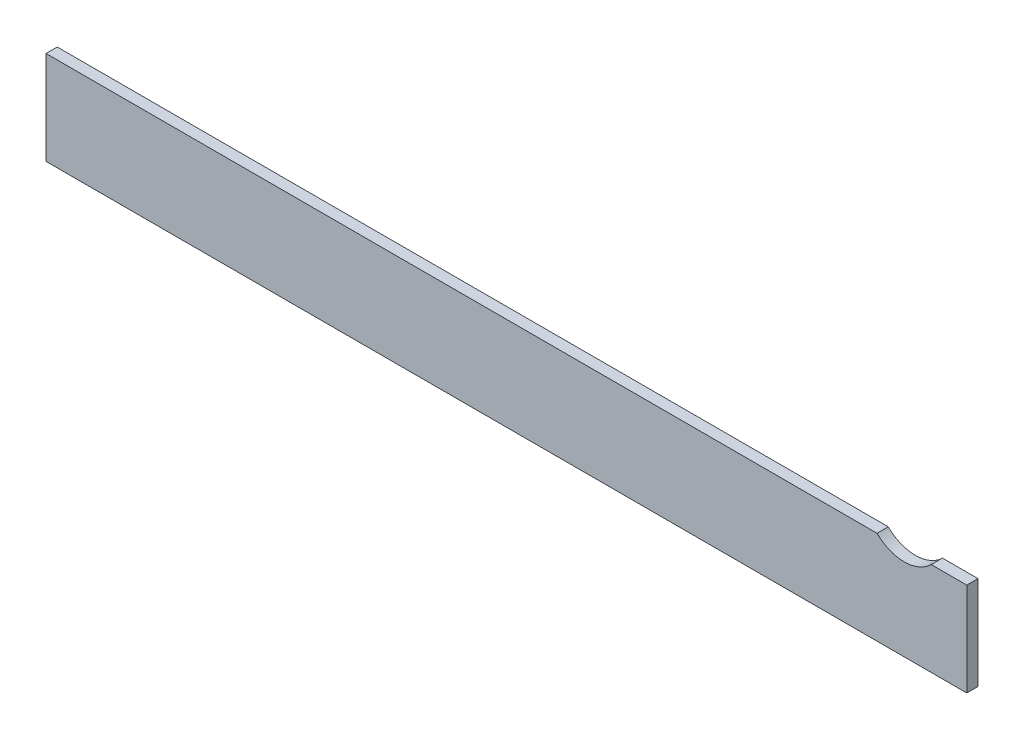
ISO-10303-21;
HEADER;
FILE_DESCRIPTION(('STEP AP214'),'2;1');
FILE_NAME('part.step','',(''),(''),'','','');
FILE_SCHEMA(('AUTOMOTIVE_DESIGN { 1 0 10303 214 1 1 1 1 }'));
ENDSEC;
DATA;
#1=APPLICATION_CONTEXT('core data for automotive mechanical design processes');
#2=APPLICATION_PROTOCOL_DEFINITION('international standard','automotive_design',2000,#1);
#3=PRODUCT_CONTEXT('',#1,'mechanical');
#4=PRODUCT('Part','Part','',(#3));
#5=PRODUCT_RELATED_PRODUCT_CATEGORY('part','',(#4));
#6=PRODUCT_DEFINITION_FORMATION('','',#4);
#7=PRODUCT_DEFINITION_CONTEXT('part definition',#1,'design');
#8=PRODUCT_DEFINITION('design','',#6,#7);
#9=PRODUCT_DEFINITION_SHAPE('','',#8);
#10=(LENGTH_UNIT() NAMED_UNIT(*) SI_UNIT(.MILLI.,.METRE.));
#11=(NAMED_UNIT(*) PLANE_ANGLE_UNIT() SI_UNIT($,.RADIAN.));
#12=(NAMED_UNIT(*) SI_UNIT($,.STERADIAN.) SOLID_ANGLE_UNIT());
#13=UNCERTAINTY_MEASURE_WITH_UNIT(LENGTH_MEASURE(1.E-05),#10,'distance_accuracy_value','');
#14=(GEOMETRIC_REPRESENTATION_CONTEXT(3) GLOBAL_UNCERTAINTY_ASSIGNED_CONTEXT((#13)) GLOBAL_UNIT_ASSIGNED_CONTEXT((#10,
#11,#12)) REPRESENTATION_CONTEXT('',''));
#15=CARTESIAN_POINT('',(0.,0.,0.));
#16=DIRECTION('',(0.,0.,1.));
#17=DIRECTION('',(1.,0.,0.));
#18=AXIS2_PLACEMENT_3D('',#15,#16,#17);
#19=CARTESIAN_POINT('',(0.,100.,12.));
#20=DIRECTION('',(1.,0.,0.));
#21=DIRECTION('',(0.,1.,0.));
#22=AXIS2_PLACEMENT_3D('',#19,#20,#21);
#23=PLANE('',#22);
#24=DIRECTION('',(0.,-1.,0.));
#25=VECTOR('',#24,1.);
#26=CARTESIAN_POINT('',(0.,100.,0.));
#27=LINE('',#26,#25);
#28=CARTESIAN_POINT('',(0.,100.,0.));
#29=VERTEX_POINT('',#28);
#30=CARTESIAN_POINT('',(0.,0.,0.));
#31=VERTEX_POINT('',#30);
#32=EDGE_CURVE('E128',#29,#31,#27,.T.);
#33=ORIENTED_EDGE('',*,*,#32,.T.);
#34=DIRECTION('',(0.,0.,-1.));
#35=VECTOR('',#34,1.);
#36=CARTESIAN_POINT('',(0.,0.,12.));
#37=LINE('',#36,#35);
#38=CARTESIAN_POINT('',(0.,0.,12.));
#39=VERTEX_POINT('',#38);
#40=EDGE_CURVE('E11',#39,#31,#37,.T.);
#41=ORIENTED_EDGE('',*,*,#40,.F.);
#42=DIRECTION('',(0.,-1.,0.));
#43=VECTOR('',#42,1.);
#44=CARTESIAN_POINT('',(0.,100.,12.));
#45=LINE('',#44,#43);
#46=CARTESIAN_POINT('',(0.,100.,12.));
#47=VERTEX_POINT('',#46);
#48=EDGE_CURVE('E144',#47,#39,#45,.T.);
#49=ORIENTED_EDGE('',*,*,#48,.F.);
#50=DIRECTION('',(0.,0.,-1.));
#51=VECTOR('',#50,1.);
#52=CARTESIAN_POINT('',(0.,100.,12.));
#53=LINE('',#52,#51);
#54=EDGE_CURVE('E124',#47,#29,#53,.T.);
#55=ORIENTED_EDGE('',*,*,#54,.T.);
#56=EDGE_LOOP('',(#33,#41,#49,#55));
#57=FACE_BOUND('',#56,.T.);
#58=ADVANCED_FACE('F39',(#57),#23,.F.);
#59=CARTESIAN_POINT('',(0.,0.,12.));
#60=DIRECTION('',(0.,1.,0.));
#61=DIRECTION('',(0.,0.,1.));
#62=AXIS2_PLACEMENT_3D('',#59,#60,#61);
#63=PLANE('',#62);
#64=DIRECTION('',(1.,0.,0.));
#65=VECTOR('',#64,1.);
#66=CARTESIAN_POINT('',(0.,0.,0.));
#67=LINE('',#66,#65);
#68=CARTESIAN_POINT('',(985.,0.,0.));
#69=VERTEX_POINT('',#68);
#70=EDGE_CURVE('E132',#31,#69,#67,.T.);
#71=ORIENTED_EDGE('',*,*,#70,.T.);
#72=DIRECTION('',(0.,0.,-1.));
#73=VECTOR('',#72,1.);
#74=CARTESIAN_POINT('',(985.,0.,12.));
#75=LINE('',#74,#73);
#76=CARTESIAN_POINT('',(985.,0.,12.));
#77=VERTEX_POINT('',#76);
#78=EDGE_CURVE('E48',#77,#69,#75,.T.);
#79=ORIENTED_EDGE('',*,*,#78,.F.);
#80=DIRECTION('',(1.,0.,0.));
#81=VECTOR('',#80,1.);
#82=CARTESIAN_POINT('',(0.,0.,12.));
#83=LINE('',#82,#81);
#84=EDGE_CURVE('E93',#39,#77,#83,.T.);
#85=ORIENTED_EDGE('',*,*,#84,.F.);
#86=ORIENTED_EDGE('',*,*,#40,.T.);
#87=EDGE_LOOP('',(#71,#79,#85,#86));
#88=FACE_BOUND('',#87,.T.);
#89=ADVANCED_FACE('F172',(#88),#63,.F.);
#90=CARTESIAN_POINT('',(985.,0.,12.));
#91=DIRECTION('',(-1.,0.,0.));
#92=DIRECTION('',(0.,0.,1.));
#93=AXIS2_PLACEMENT_3D('',#90,#91,#92);
#94=PLANE('',#93);
#95=DIRECTION('',(0.,1.,0.));
#96=VECTOR('',#95,1.);
#97=CARTESIAN_POINT('',(985.,0.,0.));
#98=LINE('',#97,#96);
#99=CARTESIAN_POINT('',(985.,100.,0.));
#100=VERTEX_POINT('',#99);
#101=EDGE_CURVE('E135',#69,#100,#98,.T.);
#102=ORIENTED_EDGE('',*,*,#101,.T.);
#103=DIRECTION('',(0.,0.,-1.));
#104=VECTOR('',#103,1.);
#105=CARTESIAN_POINT('',(985.,100.,12.));
#106=LINE('',#105,#104);
#107=CARTESIAN_POINT('',(985.,100.,12.));
#108=VERTEX_POINT('',#107);
#109=EDGE_CURVE('E117',#108,#100,#106,.T.);
#110=ORIENTED_EDGE('',*,*,#109,.F.);
#111=DIRECTION('',(0.,1.,0.));
#112=VECTOR('',#111,1.);
#113=CARTESIAN_POINT('',(985.,0.,12.));
#114=LINE('',#113,#112);
#115=EDGE_CURVE('E106',#77,#108,#114,.T.);
#116=ORIENTED_EDGE('',*,*,#115,.F.);
#117=ORIENTED_EDGE('',*,*,#78,.T.);
#118=EDGE_LOOP('',(#102,#110,#116,#117));
#119=FACE_BOUND('',#118,.T.);
#120=ADVANCED_FACE('F154',(#119),#94,.F.);
#121=CARTESIAN_POINT('',(985.,100.,12.));
#122=DIRECTION('',(0.,-1.,0.));
#123=DIRECTION('',(1.,0.,0.));
#124=AXIS2_PLACEMENT_3D('',#121,#122,#123);
#125=PLANE('',#124);
#126=DIRECTION('',(-1.,0.,0.));
#127=VECTOR('',#126,1.);
#128=CARTESIAN_POINT('',(985.,100.,0.));
#129=LINE('',#128,#127);
#130=CARTESIAN_POINT('',(946.952353926806,100.,0.));
#131=VERTEX_POINT('',#130);
#132=EDGE_CURVE('E115',#100,#131,#129,.T.);
#133=ORIENTED_EDGE('',*,*,#132,.T.);
#134=DIRECTION('',(0.,0.,-1.));
#135=VECTOR('',#134,1.);
#136=CARTESIAN_POINT('',(946.952353926806,100.,12.));
#137=LINE('',#136,#135);
#138=CARTESIAN_POINT('',(946.952353926806,100.,12.));
#139=VERTEX_POINT('',#138);
#140=EDGE_CURVE('E112',#139,#131,#137,.T.);
#141=ORIENTED_EDGE('',*,*,#140,.F.);
#142=DIRECTION('',(-1.,0.,0.));
#143=VECTOR('',#142,1.);
#144=CARTESIAN_POINT('',(985.,100.,12.));
#145=LINE('',#144,#143);
#146=EDGE_CURVE('E100',#108,#139,#145,.T.);
#147=ORIENTED_EDGE('',*,*,#146,.F.);
#148=ORIENTED_EDGE('',*,*,#109,.T.);
#149=EDGE_LOOP('',(#133,#141,#147,#148));
#150=FACE_BOUND('',#149,.T.);
#151=ADVANCED_FACE('F113',(#150),#125,.F.);
#152=CARTESIAN_POINT('',(918.,129.,12.));
#153=DIRECTION('',(0.,0.,-1.));
#154=DIRECTION('',(-1.,0.,0.));
#155=AXIS2_PLACEMENT_3D('',#152,#153,#154);
#156=CYLINDRICAL_SURFACE('',#155,40.9785162969945);
#157=CARTESIAN_POINT('',(918.,129.,0.));
#158=DIRECTION('',(0.,0.,-1.));
#159=DIRECTION('',(1.,0.,0.));
#160=AXIS2_PLACEMENT_3D('',#157,#158,#159);
#161=CIRCLE('',#160,40.9785162969945);
#162=CARTESIAN_POINT('',(889.047646073194,100.,0.));
#163=VERTEX_POINT('',#162);
#164=EDGE_CURVE('E79',#131,#163,#161,.T.);
#165=ORIENTED_EDGE('',*,*,#164,.T.);
#166=DIRECTION('',(0.,0.,-1.));
#167=VECTOR('',#166,1.);
#168=CARTESIAN_POINT('',(889.047646073194,100.,12.));
#169=LINE('',#168,#167);
#170=CARTESIAN_POINT('',(889.047646073194,100.,12.));
#171=VERTEX_POINT('',#170);
#172=EDGE_CURVE('E118',#171,#163,#169,.T.);
#173=ORIENTED_EDGE('',*,*,#172,.F.);
#174=CARTESIAN_POINT('',(918.,129.,12.));
#175=DIRECTION('',(0.,0.,-1.));
#176=DIRECTION('',(1.,0.,0.));
#177=AXIS2_PLACEMENT_3D('',#174,#175,#176);
#178=CIRCLE('',#177,40.9785162969945);
#179=EDGE_CURVE('E104',#139,#171,#178,.T.);
#180=ORIENTED_EDGE('',*,*,#179,.F.);
#181=ORIENTED_EDGE('',*,*,#140,.T.);
#182=EDGE_LOOP('',(#165,#173,#180,#181));
#183=FACE_BOUND('',#182,.T.);
#184=ADVANCED_FACE('F120',(#183),#156,.F.);
#185=CARTESIAN_POINT('',(889.047646073194,100.,12.));
#186=DIRECTION('',(0.,-1.,0.));
#187=DIRECTION('',(1.,0.,0.));
#188=AXIS2_PLACEMENT_3D('',#185,#186,#187);
#189=PLANE('',#188);
#190=DIRECTION('',(-1.,0.,0.));
#191=VECTOR('',#190,1.);
#192=CARTESIAN_POINT('',(889.047646073194,100.,0.));
#193=LINE('',#192,#191);
#194=EDGE_CURVE('E85',#163,#29,#193,.T.);
#195=ORIENTED_EDGE('',*,*,#194,.T.);
#196=ORIENTED_EDGE('',*,*,#54,.F.);
#197=DIRECTION('',(-1.,0.,0.));
#198=VECTOR('',#197,1.);
#199=CARTESIAN_POINT('',(889.047646073194,100.,12.));
#200=LINE('',#199,#198);
#201=EDGE_CURVE('E56',#171,#47,#200,.T.);
#202=ORIENTED_EDGE('',*,*,#201,.F.);
#203=ORIENTED_EDGE('',*,*,#172,.T.);
#204=EDGE_LOOP('',(#195,#196,#202,#203));
#205=FACE_BOUND('',#204,.T.);
#206=ADVANCED_FACE('F161',(#205),#189,.F.);
#207=CARTESIAN_POINT('',(918.,129.,12.));
#208=DIRECTION('',(0.,0.,1.));
#209=DIRECTION('',(1.,0.,0.));
#210=AXIS2_PLACEMENT_3D('',#207,#208,#209);
#211=PLANE('',#210);
#212=ORIENTED_EDGE('',*,*,#48,.T.);
#213=ORIENTED_EDGE('',*,*,#84,.T.);
#214=ORIENTED_EDGE('',*,*,#115,.T.);
#215=ORIENTED_EDGE('',*,*,#146,.T.);
#216=ORIENTED_EDGE('',*,*,#179,.T.);
#217=ORIENTED_EDGE('',*,*,#201,.T.);
#218=EDGE_LOOP('',(#212,#213,#214,#215,#216,#217));
#219=FACE_BOUND('',#218,.T.);
#220=ADVANCED_FACE('F102',(#219),#211,.T.);
#221=CARTESIAN_POINT('',(918.,129.,0.));
#222=DIRECTION('',(0.,0.,1.));
#223=DIRECTION('',(1.,0.,0.));
#224=AXIS2_PLACEMENT_3D('',#221,#222,#223);
#225=PLANE('',#224);
#226=ORIENTED_EDGE('',*,*,#32,.F.);
#227=ORIENTED_EDGE('',*,*,#194,.F.);
#228=ORIENTED_EDGE('',*,*,#164,.F.);
#229=ORIENTED_EDGE('',*,*,#132,.F.);
#230=ORIENTED_EDGE('',*,*,#101,.F.);
#231=ORIENTED_EDGE('',*,*,#70,.F.);
#232=EDGE_LOOP('',(#226,#227,#228,#229,#230,#231));
#233=FACE_BOUND('',#232,.T.);
#234=ADVANCED_FACE('F157',(#233),#225,.F.);
#235=CLOSED_SHELL('',(#58,#89,#120,#151,#184,#206,#220,#234));
#236=MANIFOLD_SOLID_BREP('B2',#235);
#237=ADVANCED_BREP_SHAPE_REPRESENTATION('',(#18,#236),#14);
#238=SHAPE_DEFINITION_REPRESENTATION(#9,#237);
ENDSEC;
END-ISO-10303-21;
